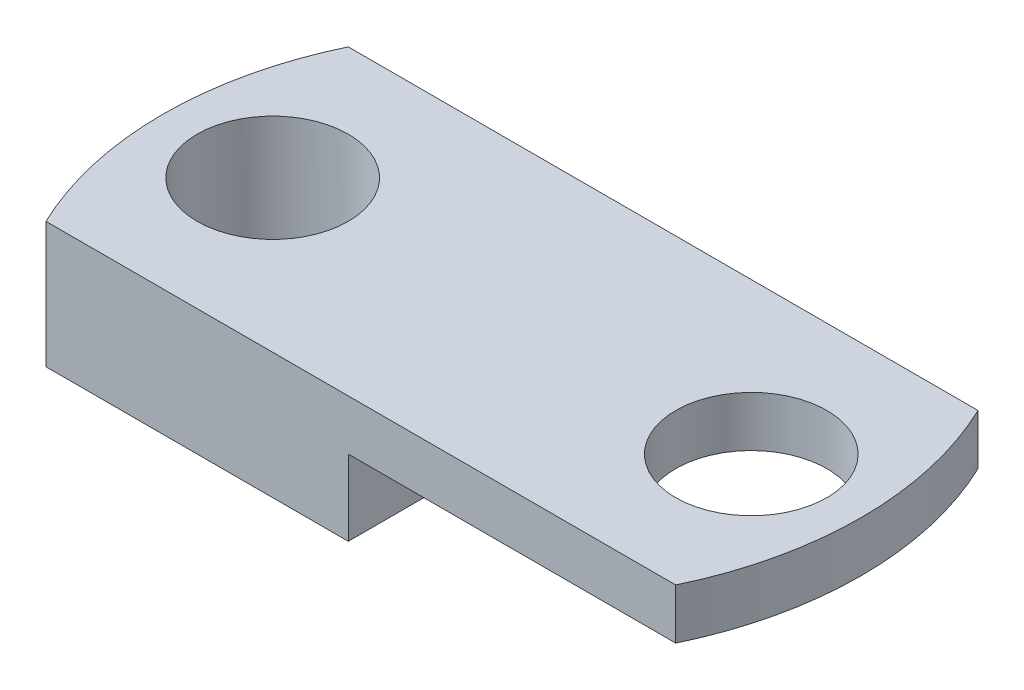
ISO-10303-21;
HEADER;
FILE_DESCRIPTION(('STEP AP214'),'2;1');
FILE_NAME('part.step','',(''),(''),'','','');
FILE_SCHEMA(('AUTOMOTIVE_DESIGN { 1 0 10303 214 1 1 1 1 }'));
ENDSEC;
DATA;
#1=APPLICATION_CONTEXT('core data for automotive mechanical design processes');
#2=APPLICATION_PROTOCOL_DEFINITION('international standard','automotive_design',2000,#1);
#3=PRODUCT_CONTEXT('',#1,'mechanical');
#4=PRODUCT('Part','Part','',(#3));
#5=PRODUCT_RELATED_PRODUCT_CATEGORY('part','',(#4));
#6=PRODUCT_DEFINITION_FORMATION('','',#4);
#7=PRODUCT_DEFINITION_CONTEXT('part definition',#1,'design');
#8=PRODUCT_DEFINITION('design','',#6,#7);
#9=PRODUCT_DEFINITION_SHAPE('','',#8);
#10=(LENGTH_UNIT() NAMED_UNIT(*) SI_UNIT(.MILLI.,.METRE.));
#11=(NAMED_UNIT(*) PLANE_ANGLE_UNIT() SI_UNIT($,.RADIAN.));
#12=(NAMED_UNIT(*) SI_UNIT($,.STERADIAN.) SOLID_ANGLE_UNIT());
#13=UNCERTAINTY_MEASURE_WITH_UNIT(LENGTH_MEASURE(1.E-05),#10,'distance_accuracy_value','');
#14=(GEOMETRIC_REPRESENTATION_CONTEXT(3) GLOBAL_UNCERTAINTY_ASSIGNED_CONTEXT((#13)) GLOBAL_UNIT_ASSIGNED_CONTEXT((#10,
#11,#12)) REPRESENTATION_CONTEXT('',''));
#15=CARTESIAN_POINT('',(0.,0.,0.));
#16=DIRECTION('',(0.,0.,1.));
#17=DIRECTION('',(1.,0.,0.));
#18=AXIS2_PLACEMENT_3D('',#15,#16,#17);
#19=CARTESIAN_POINT('',(0.,6.35,0.));
#20=DIRECTION('',(0.,-1.,0.));
#21=DIRECTION('',(0.,0.,-1.));
#22=AXIS2_PLACEMENT_3D('',#19,#20,#21);
#23=CYLINDRICAL_SURFACE('',#22,17.6090892723048);
#24=DIRECTION('',(0.,-1.,0.));
#25=VECTOR('',#24,1.);
#26=CARTESIAN_POINT('',(15.875,6.35,7.62));
#27=LINE('',#26,#25);
#28=CARTESIAN_POINT('',(15.875,6.35,7.62));
#29=VERTEX_POINT('',#28);
#30=CARTESIAN_POINT('',(15.875,3.81,7.62));
#31=VERTEX_POINT('',#30);
#32=EDGE_CURVE('E119',#29,#31,#27,.T.);
#33=ORIENTED_EDGE('',*,*,#32,.T.);
#34=CARTESIAN_POINT('',(0.,3.81,0.));
#35=DIRECTION('',(0.,-1.,0.));
#36=DIRECTION('',(0.,0.,1.));
#37=AXIS2_PLACEMENT_3D('',#34,#35,#36);
#38=CIRCLE('',#37,17.6090892723048);
#39=CARTESIAN_POINT('',(15.875,3.81,-7.62));
#40=VERTEX_POINT('',#39);
#41=EDGE_CURVE('E103',#40,#31,#38,.T.);
#42=ORIENTED_EDGE('',*,*,#41,.F.);
#43=DIRECTION('',(0.,-1.,0.));
#44=VECTOR('',#43,1.);
#45=CARTESIAN_POINT('',(15.875,6.35,-7.62));
#46=LINE('',#45,#44);
#47=CARTESIAN_POINT('',(15.875,6.35,-7.62));
#48=VERTEX_POINT('',#47);
#49=EDGE_CURVE('E11',#48,#40,#46,.T.);
#50=ORIENTED_EDGE('',*,*,#49,.F.);
#51=CARTESIAN_POINT('',(0.,6.35,0.));
#52=DIRECTION('',(0.,1.,0.));
#53=DIRECTION('',(0.,0.,1.));
#54=AXIS2_PLACEMENT_3D('',#51,#52,#53);
#55=CIRCLE('',#54,17.6090892723048);
#56=EDGE_CURVE('E123',#29,#48,#55,.T.);
#57=ORIENTED_EDGE('',*,*,#56,.F.);
#58=EDGE_LOOP('',(#33,#42,#50,#57));
#59=FACE_BOUND('',#58,.T.);
#60=ADVANCED_FACE('F39',(#59),#23,.T.);
#61=CARTESIAN_POINT('',(-15.875,6.35,-7.62));
#62=DIRECTION('',(0.,0.,1.));
#63=DIRECTION('',(1.,0.,0.));
#64=AXIS2_PLACEMENT_3D('',#61,#62,#63);
#65=PLANE('',#64);
#66=DIRECTION('',(1.,0.,0.));
#67=VECTOR('',#66,1.);
#68=CARTESIAN_POINT('',(15.875,3.81,-7.62));
#69=LINE('',#68,#67);
#70=CARTESIAN_POINT('',(-0.635000000000007,3.81,-7.62));
#71=VERTEX_POINT('',#70);
#72=EDGE_CURVE('E110',#71,#40,#69,.T.);
#73=ORIENTED_EDGE('',*,*,#72,.F.);
#74=DIRECTION('',(0.,-1.,0.));
#75=VECTOR('',#74,1.);
#76=CARTESIAN_POINT('',(-0.635000000000007,3.81,-7.62));
#77=LINE('',#76,#75);
#78=CARTESIAN_POINT('',(-0.635000000000007,0.,-7.62));
#79=VERTEX_POINT('',#78);
#80=EDGE_CURVE('E160',#71,#79,#77,.T.);
#81=ORIENTED_EDGE('',*,*,#80,.T.);
#82=DIRECTION('',(-1.,0.,0.));
#83=VECTOR('',#82,1.);
#84=CARTESIAN_POINT('',(-15.875,0.,-7.62));
#85=LINE('',#84,#83);
#86=CARTESIAN_POINT('',(-15.875,0.,-7.62));
#87=VERTEX_POINT('',#86);
#88=EDGE_CURVE('E135',#79,#87,#85,.T.);
#89=ORIENTED_EDGE('',*,*,#88,.T.);
#90=DIRECTION('',(0.,-1.,0.));
#91=VECTOR('',#90,1.);
#92=CARTESIAN_POINT('',(-15.875,6.35,-7.62));
#93=LINE('',#92,#91);
#94=CARTESIAN_POINT('',(-15.875,6.35,-7.62));
#95=VERTEX_POINT('',#94);
#96=EDGE_CURVE('E47',#95,#87,#93,.T.);
#97=ORIENTED_EDGE('',*,*,#96,.F.);
#98=DIRECTION('',(-1.,0.,0.));
#99=VECTOR('',#98,1.);
#100=CARTESIAN_POINT('',(-15.875,6.35,-7.62));
#101=LINE('',#100,#99);
#102=EDGE_CURVE('E87',#48,#95,#101,.T.);
#103=ORIENTED_EDGE('',*,*,#102,.F.);
#104=ORIENTED_EDGE('',*,*,#49,.T.);
#105=EDGE_LOOP('',(#73,#81,#89,#97,#103,#104));
#106=FACE_BOUND('',#105,.T.);
#107=ADVANCED_FACE('F162',(#106),#65,.F.);
#108=CARTESIAN_POINT('',(0.,6.35,0.));
#109=DIRECTION('',(0.,-1.,0.));
#110=DIRECTION('',(0.,0.,-1.));
#111=AXIS2_PLACEMENT_3D('',#108,#109,#110);
#112=CYLINDRICAL_SURFACE('',#111,17.6090892723048);
#113=CARTESIAN_POINT('',(0.,0.,0.));
#114=DIRECTION('',(0.,1.,0.));
#115=DIRECTION('',(0.,0.,1.));
#116=AXIS2_PLACEMENT_3D('',#113,#114,#115);
#117=CIRCLE('',#116,17.6090892723048);
#118=CARTESIAN_POINT('',(-15.875,0.,7.62));
#119=VERTEX_POINT('',#118);
#120=EDGE_CURVE('E80',#87,#119,#117,.T.);
#121=ORIENTED_EDGE('',*,*,#120,.T.);
#122=DIRECTION('',(0.,-1.,0.));
#123=VECTOR('',#122,1.);
#124=CARTESIAN_POINT('',(-15.875,6.35,7.62));
#125=LINE('',#124,#123);
#126=CARTESIAN_POINT('',(-15.875,6.35,7.62));
#127=VERTEX_POINT('',#126);
#128=EDGE_CURVE('E124',#127,#119,#125,.T.);
#129=ORIENTED_EDGE('',*,*,#128,.F.);
#130=CARTESIAN_POINT('',(0.,6.35,0.));
#131=DIRECTION('',(0.,1.,0.));
#132=DIRECTION('',(0.,0.,1.));
#133=AXIS2_PLACEMENT_3D('',#130,#131,#132);
#134=CIRCLE('',#133,17.6090892723048);
#135=EDGE_CURVE('E127',#95,#127,#134,.T.);
#136=ORIENTED_EDGE('',*,*,#135,.F.);
#137=ORIENTED_EDGE('',*,*,#96,.T.);
#138=EDGE_LOOP('',(#121,#129,#136,#137));
#139=FACE_BOUND('',#138,.T.);
#140=ADVANCED_FACE('F164',(#139),#112,.T.);
#141=CARTESIAN_POINT('',(-15.875,6.35,7.62));
#142=DIRECTION('',(0.,0.,-1.));
#143=DIRECTION('',(-1.,0.,0.));
#144=AXIS2_PLACEMENT_3D('',#141,#142,#143);
#145=PLANE('',#144);
#146=DIRECTION('',(1.,0.,0.));
#147=VECTOR('',#146,1.);
#148=CARTESIAN_POINT('',(-15.875,0.,7.62));
#149=LINE('',#148,#147);
#150=CARTESIAN_POINT('',(-0.635000000000011,0.,7.62));
#151=VERTEX_POINT('',#150);
#152=EDGE_CURVE('E130',#119,#151,#149,.T.);
#153=ORIENTED_EDGE('',*,*,#152,.T.);
#154=DIRECTION('',(0.,-1.,0.));
#155=VECTOR('',#154,1.);
#156=CARTESIAN_POINT('',(-0.635000000000011,3.81,7.61999999999999));
#157=LINE('',#156,#155);
#158=CARTESIAN_POINT('',(-0.635000000000011,3.81,7.61999999999999));
#159=VERTEX_POINT('',#158);
#160=EDGE_CURVE('E55',#159,#151,#157,.T.);
#161=ORIENTED_EDGE('',*,*,#160,.F.);
#162=DIRECTION('',(-1.,0.,0.));
#163=VECTOR('',#162,1.);
#164=CARTESIAN_POINT('',(15.875,3.81,7.62));
#165=LINE('',#164,#163);
#166=EDGE_CURVE('E108',#31,#159,#165,.T.);
#167=ORIENTED_EDGE('',*,*,#166,.F.);
#168=ORIENTED_EDGE('',*,*,#32,.F.);
#169=DIRECTION('',(1.,0.,0.));
#170=VECTOR('',#169,1.);
#171=CARTESIAN_POINT('',(-15.875,6.35,7.62));
#172=LINE('',#171,#170);
#173=EDGE_CURVE('E64',#127,#29,#172,.T.);
#174=ORIENTED_EDGE('',*,*,#173,.F.);
#175=ORIENTED_EDGE('',*,*,#128,.T.);
#176=EDGE_LOOP('',(#153,#161,#167,#168,#174,#175));
#177=FACE_BOUND('',#176,.T.);
#178=ADVANCED_FACE('F118',(#177),#145,.F.);
#179=CARTESIAN_POINT('',(0.,6.35,0.));
#180=DIRECTION('',(0.,1.,0.));
#181=DIRECTION('',(0.,0.,1.));
#182=AXIS2_PLACEMENT_3D('',#179,#180,#181);
#183=PLANE('',#182);
#184=CARTESIAN_POINT('',(-12.065,6.35,0.));
#185=DIRECTION('',(0.,1.,0.));
#186=DIRECTION('',(0.,0.,-1.));
#187=AXIS2_PLACEMENT_3D('',#184,#185,#186);
#188=CIRCLE('',#187,3.81);
#189=CARTESIAN_POINT('',(-12.065,6.35,-3.81));
#190=VERTEX_POINT('',#189);
#191=EDGE_CURVE('E136',#190,#190,#188,.T.);
#192=ORIENTED_EDGE('',*,*,#191,.F.);
#193=EDGE_LOOP('',(#192));
#194=FACE_BOUND('',#193,.T.);
#195=CARTESIAN_POINT('',(12.065,6.35,0.));
#196=DIRECTION('',(0.,1.,0.));
#197=DIRECTION('',(0.,0.,1.));
#198=AXIS2_PLACEMENT_3D('',#195,#196,#197);
#199=CIRCLE('',#198,3.80999999999999);
#200=CARTESIAN_POINT('',(12.065,6.35,3.80999999999999));
#201=VERTEX_POINT('',#200);
#202=EDGE_CURVE('E141',#201,#201,#199,.T.);
#203=ORIENTED_EDGE('',*,*,#202,.F.);
#204=EDGE_LOOP('',(#203));
#205=FACE_BOUND('',#204,.T.);
#206=ORIENTED_EDGE('',*,*,#56,.T.);
#207=ORIENTED_EDGE('',*,*,#102,.T.);
#208=ORIENTED_EDGE('',*,*,#135,.T.);
#209=ORIENTED_EDGE('',*,*,#173,.T.);
#210=EDGE_LOOP('',(#206,#207,#208,#209));
#211=FACE_BOUND('',#210,.T.);
#212=ADVANCED_FACE('F173',(#194,#205,#211),#183,.T.);
#213=CARTESIAN_POINT('',(0.,0.,0.));
#214=DIRECTION('',(0.,1.,0.));
#215=DIRECTION('',(0.,0.,1.));
#216=AXIS2_PLACEMENT_3D('',#213,#214,#215);
#217=PLANE('',#216);
#218=CARTESIAN_POINT('',(-12.065,0.,0.));
#219=DIRECTION('',(0.,1.,0.));
#220=DIRECTION('',(0.,0.,1.));
#221=AXIS2_PLACEMENT_3D('',#218,#219,#220);
#222=CIRCLE('',#221,3.81);
#223=CARTESIAN_POINT('',(-12.065,0.,3.81000000000001));
#224=VERTEX_POINT('',#223);
#225=EDGE_CURVE('E133',#224,#224,#222,.T.);
#226=ORIENTED_EDGE('',*,*,#225,.T.);
#227=EDGE_LOOP('',(#226));
#228=FACE_BOUND('',#227,.T.);
#229=ORIENTED_EDGE('',*,*,#88,.F.);
#230=DIRECTION('',(0.,0.,-1.));
#231=VECTOR('',#230,1.);
#232=CARTESIAN_POINT('',(-0.635000000000011,0.,7.61999999999999));
#233=LINE('',#232,#231);
#234=EDGE_CURVE('E114',#151,#79,#233,.T.);
#235=ORIENTED_EDGE('',*,*,#234,.F.);
#236=ORIENTED_EDGE('',*,*,#152,.F.);
#237=ORIENTED_EDGE('',*,*,#120,.F.);
#238=EDGE_LOOP('',(#229,#235,#236,#237));
#239=FACE_BOUND('',#238,.T.);
#240=ADVANCED_FACE('F155',(#228,#239),#217,.F.);
#241=CARTESIAN_POINT('',(12.065,-6.35,0.));
#242=DIRECTION('',(0.,1.,0.));
#243=DIRECTION('',(0.,0.,1.));
#244=AXIS2_PLACEMENT_3D('',#241,#242,#243);
#245=CYLINDRICAL_SURFACE('',#244,3.80999999999999);
#246=CARTESIAN_POINT('',(12.065,3.81,0.));
#247=DIRECTION('',(0.,1.,0.));
#248=DIRECTION('',(0.,0.,1.));
#249=AXIS2_PLACEMENT_3D('',#246,#247,#248);
#250=CIRCLE('',#249,3.80999999999999);
#251=CARTESIAN_POINT('',(12.065,3.81,3.80999999999999));
#252=VERTEX_POINT('',#251);
#253=EDGE_CURVE('E42',#252,#252,#250,.F.);
#254=ORIENTED_EDGE('',*,*,#253,.T.);
#255=EDGE_LOOP('',(#254));
#256=FACE_BOUND('',#255,.T.);
#257=ORIENTED_EDGE('',*,*,#202,.T.);
#258=EDGE_LOOP('',(#257));
#259=FACE_BOUND('',#258,.T.);
#260=ADVANCED_FACE('F176',(#256,#259),#245,.F.);
#261=CARTESIAN_POINT('',(-12.065,-6.35,0.));
#262=DIRECTION('',(0.,1.,0.));
#263=DIRECTION('',(0.,0.,1.));
#264=AXIS2_PLACEMENT_3D('',#261,#262,#263);
#265=CYLINDRICAL_SURFACE('',#264,3.81);
#266=ORIENTED_EDGE('',*,*,#191,.T.);
#267=EDGE_LOOP('',(#266));
#268=FACE_BOUND('',#267,.T.);
#269=ORIENTED_EDGE('',*,*,#225,.F.);
#270=EDGE_LOOP('',(#269));
#271=FACE_BOUND('',#270,.T.);
#272=ADVANCED_FACE('F182',(#268,#271),#265,.F.);
#273=CARTESIAN_POINT('',(0.,3.81,0.));
#274=DIRECTION('',(0.,1.,0.));
#275=DIRECTION('',(0.,0.,1.));
#276=AXIS2_PLACEMENT_3D('',#273,#274,#275);
#277=PLANE('',#276);
#278=ORIENTED_EDGE('',*,*,#41,.T.);
#279=ORIENTED_EDGE('',*,*,#166,.T.);
#280=DIRECTION('',(0.,0.,-1.));
#281=VECTOR('',#280,1.);
#282=CARTESIAN_POINT('',(-0.635000000000011,3.81,7.61999999999999));
#283=LINE('',#282,#281);
#284=EDGE_CURVE('E121',#159,#71,#283,.T.);
#285=ORIENTED_EDGE('',*,*,#284,.T.);
#286=ORIENTED_EDGE('',*,*,#72,.T.);
#287=EDGE_LOOP('',(#278,#279,#285,#286));
#288=FACE_BOUND('',#287,.T.);
#289=ORIENTED_EDGE('',*,*,#253,.F.);
#290=EDGE_LOOP('',(#289));
#291=FACE_BOUND('',#290,.T.);
#292=ADVANCED_FACE('F105',(#288,#291),#277,.F.);
#293=CARTESIAN_POINT('',(-0.635000000000011,3.81,7.61999999999999));
#294=DIRECTION('',(-1.,0.,0.));
#295=DIRECTION('',(0.,0.,1.));
#296=AXIS2_PLACEMENT_3D('',#293,#294,#295);
#297=PLANE('',#296);
#298=ORIENTED_EDGE('',*,*,#234,.T.);
#299=ORIENTED_EDGE('',*,*,#80,.F.);
#300=ORIENTED_EDGE('',*,*,#284,.F.);
#301=ORIENTED_EDGE('',*,*,#160,.T.);
#302=EDGE_LOOP('',(#298,#299,#300,#301));
#303=FACE_BOUND('',#302,.T.);
#304=ADVANCED_FACE('F186',(#303),#297,.F.);
#305=CLOSED_SHELL('',(#60,#107,#140,#178,#212,#240,#260,#272,#292,#304));
#306=MANIFOLD_SOLID_BREP('B2',#305);
#307=ADVANCED_BREP_SHAPE_REPRESENTATION('',(#18,#306),#14);
#308=SHAPE_DEFINITION_REPRESENTATION(#9,#307);
ENDSEC;
END-ISO-10303-21;
